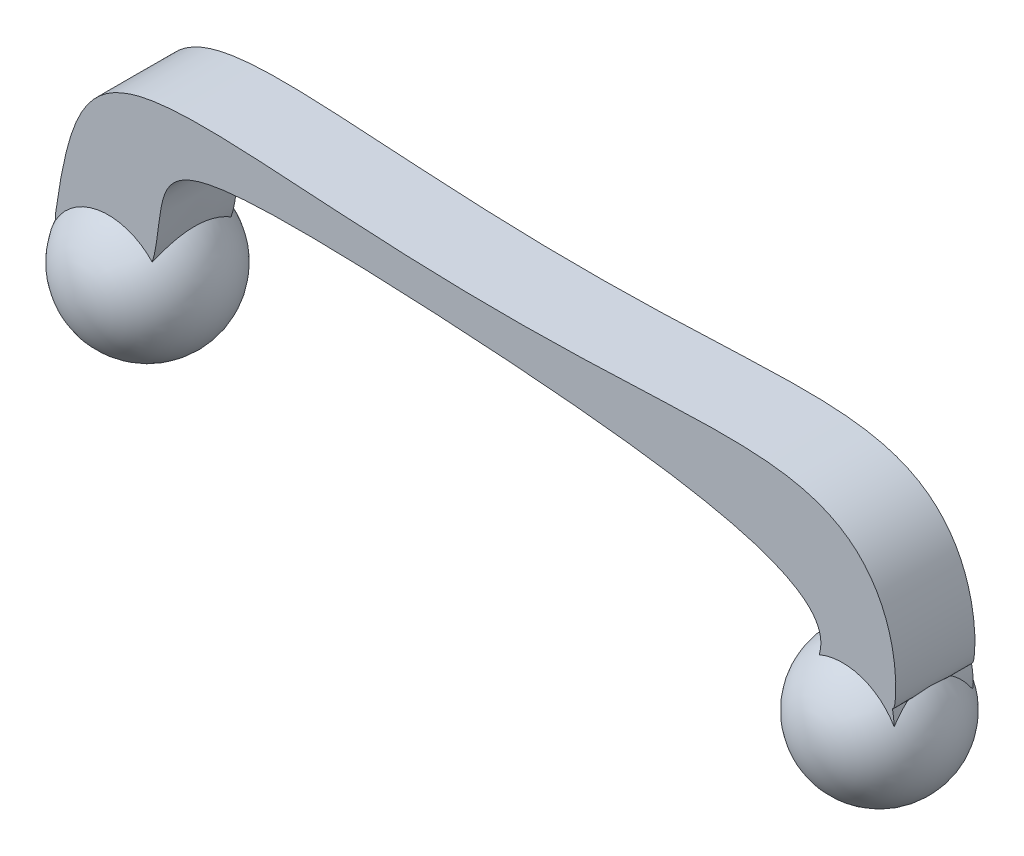
ISO-10303-21;
HEADER;
FILE_DESCRIPTION(('STEP AP214'),'2;1');
FILE_NAME('part.step','',(''),(''),'','','');
FILE_SCHEMA(('AUTOMOTIVE_DESIGN { 1 0 10303 214 1 1 1 1 }'));
ENDSEC;
DATA;
#1=APPLICATION_CONTEXT('core data for automotive mechanical design processes');
#2=APPLICATION_PROTOCOL_DEFINITION('international standard','automotive_design',2000,#1);
#3=PRODUCT_CONTEXT('',#1,'mechanical');
#4=PRODUCT('Part','Part','',(#3));
#5=PRODUCT_RELATED_PRODUCT_CATEGORY('part','',(#4));
#6=PRODUCT_DEFINITION_FORMATION('','',#4);
#7=PRODUCT_DEFINITION_CONTEXT('part definition',#1,'design');
#8=PRODUCT_DEFINITION('design','',#6,#7);
#9=PRODUCT_DEFINITION_SHAPE('','',#8);
#10=(LENGTH_UNIT() NAMED_UNIT(*) SI_UNIT(.MILLI.,.METRE.));
#11=(NAMED_UNIT(*) PLANE_ANGLE_UNIT() SI_UNIT($,.RADIAN.));
#12=(NAMED_UNIT(*) SI_UNIT($,.STERADIAN.) SOLID_ANGLE_UNIT());
#13=UNCERTAINTY_MEASURE_WITH_UNIT(LENGTH_MEASURE(1.E-05),#10,'distance_accuracy_value','');
#14=(GEOMETRIC_REPRESENTATION_CONTEXT(3) GLOBAL_UNCERTAINTY_ASSIGNED_CONTEXT((#13)) GLOBAL_UNIT_ASSIGNED_CONTEXT((#10,
#11,#12)) REPRESENTATION_CONTEXT('',''));
#15=CARTESIAN_POINT('',(0.,0.,0.));
#16=DIRECTION('',(0.,0.,1.));
#17=DIRECTION('',(1.,0.,0.));
#18=AXIS2_PLACEMENT_3D('',#15,#16,#17);
#19=CARTESIAN_POINT('',(-104.482356562855,8.81400948857931,20.));
#20=CARTESIAN_POINT('',(-95.09202808738,75.3130778429761,20.));
#21=CARTESIAN_POINT('',(-84.4902281871782,41.6847358712218,20.));
#22=CARTESIAN_POINT('',(9.726850280041,37.8584270703556,20.));
#23=CARTESIAN_POINT('',(57.4074889076928,30.9924151079737,20.));
#24=CARTESIAN_POINT('',(74.6784281191779,60.2177169992686,20.));
#25=CARTESIAN_POINT('',(116.438403635151,65.8559036124338,20.));
#26=CARTESIAN_POINT('',(108.794341703337,0.968671597092907,20.));
#27=CARTESIAN_POINT('',(107.045589444412,6.59260999092965,20.));
#28=B_SPLINE_CURVE_WITH_KNOTS('',8,(#19,#20,#21,#22,#23,#24,#25,#26,#27),.UNSPECIFIED.,.F.,.F.,
(9,9),(0.,1.),.UNSPECIFIED.);
#29=DIRECTION('',(0.,0.,-1.));
#30=VECTOR('',#29,1.);
#31=SURFACE_OF_LINEAR_EXTRUSION('',#28,#30);
#32=DIRECTION('',(0.,0.,-1.));
#33=VECTOR('',#32,1.);
#34=CARTESIAN_POINT('',(-104.482356562855,8.81400948857931,20.));
#35=LINE('',#34,#33);
#36=CARTESIAN_POINT('',(-104.482356562855,8.81400948857931,1.47437474805452));
#37=VERTEX_POINT('',#36);
#38=CARTESIAN_POINT('',(-104.482356562855,8.81400948857931,0.));
#39=VERTEX_POINT('',#38);
#40=EDGE_CURVE('E217',#37,#39,#35,.T.);
#41=ORIENTED_EDGE('',*,*,#40,.F.);
#42=CARTESIAN_POINT('',(-104.482356562855,8.81400948857931,1.47437474805452));
#43=CARTESIAN_POINT('',(-104.448349344307,9.05486120450175,1.66752577923602));
#44=CARTESIAN_POINT('',(-104.415191793325,9.28777613294737,1.87072953844081));
#45=CARTESIAN_POINT('',(-104.350884125116,9.7361808750417,2.29584194176652));
#46=CARTESIAN_POINT('',(-104.319734107554,9.95166982370556,2.51775151328488));
#47=CARTESIAN_POINT('',(-104.259747662257,10.3636837989235,2.97889687021337));
#48=CARTESIAN_POINT('',(-104.230911650406,10.5602054178664,3.21813575548927));
#49=CARTESIAN_POINT('',(-104.175873326953,10.9327945807937,3.71231859034012));
#50=CARTESIAN_POINT('',(-104.149670923955,11.1088628346252,3.9672619944096));
#51=CARTESIAN_POINT('',(-104.100181745961,11.4393789413262,4.49141396094666));
#52=CARTESIAN_POINT('',(-104.076897774296,11.593806023092,4.76063589093302));
#53=CARTESIAN_POINT('',(-104.03356830889,11.8796355502187,5.31128497180976));
#54=CARTESIAN_POINT('',(-104.013522762355,12.0110383709258,5.5927119236381));
#55=CARTESIAN_POINT('',(-103.976946904269,12.2497159788948,6.16569316470414));
#56=CARTESIAN_POINT('',(-103.960415016666,12.3570015851821,6.45724284483075));
#57=CARTESIAN_POINT('',(-103.9310892889,12.5466378312827,7.04852511056067));
#58=CARTESIAN_POINT('',(-103.918295406392,12.6289887535624,7.34825760342507));
#59=CARTESIAN_POINT('',(-103.896685163428,12.7677415204269,7.95234071964801));
#60=CARTESIAN_POINT('',(-103.887850562606,12.8242623880637,8.25666334641474));
#61=CARTESIAN_POINT('',(-103.874205675768,12.9114388472766,8.86908256650465));
#62=CARTESIAN_POINT('',(-103.869395392018,12.9420944242806,9.17717916195394));
#63=CARTESIAN_POINT('',(-103.8638732399,12.9772795428153,9.79493142187764));
#64=CARTESIAN_POINT('',(-103.863161821568,12.9818062155085,10.1045872538136));
#65=CARTESIAN_POINT('',(-103.865849739549,12.9646867031594,10.7231541651449));
#66=CARTESIAN_POINT('',(-103.869249031195,12.9430408025005,11.0320652525959));
#67=CARTESIAN_POINT('',(-103.880030687959,12.8742396094711,11.6426581921277));
#68=CARTESIAN_POINT('',(-103.887357685637,12.8274388915152,11.9443810558555));
#69=CARTESIAN_POINT('',(-103.905849622282,12.7089488993142,12.5427775707949));
#70=CARTESIAN_POINT('',(-103.917014546207,12.637259722618,12.8394512417916));
#71=CARTESIAN_POINT('',(-103.94302359911,12.4695605408001,13.4257385962349));
#72=CARTESIAN_POINT('',(-103.957868458157,12.3735457095952,13.7153508662228));
#73=CARTESIAN_POINT('',(-103.991029557946,12.1579718663242,14.2854607634097));
#74=CARTESIAN_POINT('',(-104.009345735807,12.0384132807411,14.5659585556056));
#75=CARTESIAN_POINT('',(-104.049339338085,11.7758168959785,15.1177755665874));
#76=CARTESIAN_POINT('',(-104.071038195592,11.6326290139728,15.3890217953192));
#77=CARTESIAN_POINT('',(-104.117434371971,11.3244386773162,15.9185569858142));
#78=CARTESIAN_POINT('',(-104.142131733715,11.1594359107427,16.176845762231));
#79=CARTESIAN_POINT('',(-104.194207510413,10.8090225765707,16.6785231557738));
#80=CARTESIAN_POINT('',(-104.221583363026,10.623631492504,16.9219256582304));
#81=CARTESIAN_POINT('',(-104.278726385181,10.2337249797669,17.3924449810403));
#82=CARTESIAN_POINT('',(-104.308492546346,10.0292176095788,17.6195685930679));
#83=CARTESIAN_POINT('',(-104.362102242241,9.65801043980772,17.9993659301554));
#84=CARTESIAN_POINT('',(-104.385472744995,9.49531055092223,18.1560397691542));
#85=CARTESIAN_POINT('',(-104.433197478164,9.16114138920475,18.4589222138687));
#86=CARTESIAN_POINT('',(-104.457549788032,8.98968907750674,18.6051498347878));
#87=CARTESIAN_POINT('',(-104.482356562855,8.81400948857931,18.7460556834493));
#88=B_SPLINE_CURVE_WITH_KNOTS('',3,(#42,#43,#44,#45,#46,#47,#48,#49,#50,#51,#52,#53,#54,#55,#56,
#57,#58,#59,#60,#61,#62,#63,#64,#65,#66,#67,#68,#69,#70,#71,#72,#73,#74,#75,#76,#77,#78,#79,#80,
#81,#82,#83,#84,#85,#86,#87),.UNSPECIFIED.,.F.,.F.,(4,2,2,2,2,2,2,2,2,2,2,2,2,2,2,2,2,2,2,2,2,2,
4),(0.,0.931548810494979,1.86314383254505,2.79490591171206,3.72663564381903,4.65925360949773,
5.59185637003728,6.5240399246898,7.45621291893606,8.38404610894937,9.31187982169567,
10.2398154045253,11.1677409047812,12.0829171034228,12.9980897151204,13.9134440346736,
14.8287817745774,15.7501744527139,16.6715803069145,17.5921131731836,18.5122597233857,
19.193098630002,19.8726648440729),.UNSPECIFIED.);
#89=CARTESIAN_POINT('',(-104.482356562855,8.81400948857931,18.7460556834494));
#90=VERTEX_POINT('',#89);
#91=EDGE_CURVE('E55',#37,#90,#88,.T.);
#92=ORIENTED_EDGE('',*,*,#91,.T.);
#93=CARTESIAN_POINT('',(-104.482356562855,8.81400948857931,20.));
#94=VERTEX_POINT('',#93);
#95=EDGE_CURVE('E212',#94,#90,#35,.T.);
#96=ORIENTED_EDGE('',*,*,#95,.F.);
#97=CARTESIAN_POINT('',(107.045589444412,6.59260999092965,20.));
#98=VERTEX_POINT('',#97);
#99=EDGE_CURVE('E184',#94,#98,#28,.T.);
#100=ORIENTED_EDGE('',*,*,#99,.T.);
#101=DIRECTION('',(0.,0.,-1.));
#102=VECTOR('',#101,1.);
#103=CARTESIAN_POINT('',(107.045589444412,6.59260999092965,20.));
#104=LINE('',#103,#102);
#105=CARTESIAN_POINT('',(107.045589444412,6.59260999092965,15.3185997622126));
#106=VERTEX_POINT('',#105);
#107=EDGE_CURVE('E218',#98,#106,#104,.T.);
#108=ORIENTED_EDGE('',*,*,#107,.T.);
#109=CARTESIAN_POINT('',(107.045589444412,6.59260999092965,15.3185997622126));
#110=CARTESIAN_POINT('',(107.047852558962,6.58533822645184,15.3307501389425));
#111=CARTESIAN_POINT('',(107.050201666601,6.57797422295706,15.3428317128639));
#112=CARTESIAN_POINT('',(107.055151853106,6.56292681020765,15.3669776545463));
#113=CARTESIAN_POINT('',(107.057755930457,6.55524041518214,15.3790395423399));
#114=CARTESIAN_POINT('',(107.063254072653,6.53956083194176,15.4030075164602));
#115=CARTESIAN_POINT('',(107.066149848902,6.53156602594324,15.4149121570222));
#116=CARTESIAN_POINT('',(107.072704839191,6.5141688540983,15.4399935927868));
#117=CARTESIAN_POINT('',(107.076414354766,6.50472157346992,15.4531267228238));
#118=CARTESIAN_POINT('',(107.08444065505,6.48535603876325,15.4787530013075));
#119=CARTESIAN_POINT('',(107.088754624941,6.47544010143934,15.491248769416));
#120=CARTESIAN_POINT('',(107.098279272054,6.45495774578541,15.5152715706438));
#121=CARTESIAN_POINT('',(107.103485583328,6.44439464831938,15.5268029317068));
#122=CARTESIAN_POINT('',(107.112655092681,6.4274391803011,15.5430560781248));
#123=CARTESIAN_POINT('',(107.116064502342,6.42140101842827,15.5484442939841));
#124=CARTESIAN_POINT('',(107.123467738214,6.40905179602087,15.5582948569977));
#125=CARTESIAN_POINT('',(107.127454704321,6.40274447967277,15.5627667599669));
#126=CARTESIAN_POINT('',(107.136011981557,6.39022691949254,15.5699190962084));
#127=CARTESIAN_POINT('',(107.140519621516,6.38404238489631,15.5727053348342));
#128=CARTESIAN_POINT('',(107.147985447537,6.37474650842743,15.5750689410714));
#129=CARTESIAN_POINT('',(107.1506176039,6.37161731242451,15.5755501724417));
#130=CARTESIAN_POINT('',(107.156060987468,6.36550089655595,15.5757047693377));
#131=CARTESIAN_POINT('',(107.158871593864,6.36251324149844,15.5753808005392));
#132=CARTESIAN_POINT('',(107.16413530546,6.3572586990035,15.5739679843359));
#133=CARTESIAN_POINT('',(107.166579785772,6.35495056975001,15.5729993835283));
#134=CARTESIAN_POINT('',(107.17142887461,6.35062661384059,15.5704753932266));
#135=CARTESIAN_POINT('',(107.173833401214,6.34861133456667,15.5689189239647));
#136=CARTESIAN_POINT('',(107.181778090478,6.34234314794505,15.5628508777395));
#137=CARTESIAN_POINT('',(107.187056909085,6.33884908068374,15.5572289742374));
#138=CARTESIAN_POINT('',(107.196205387076,6.33360993947893,15.5455352102611));
#139=CARTESIAN_POINT('',(107.200166560521,6.33171320646979,15.5395835630594));
#140=CARTESIAN_POINT('',(107.207613259491,6.32864518752891,15.5271930825665));
#141=CARTESIAN_POINT('',(107.211097192782,6.3274762860121,15.5207527247258));
#142=CARTESIAN_POINT('',(107.21979602353,6.3250643270128,15.5034338995626));
#143=CARTESIAN_POINT('',(107.224696535299,6.32425007955465,15.4923463001038));
#144=CARTESIAN_POINT('',(107.233843204618,6.32343006575067,15.4699029356473));
#145=CARTESIAN_POINT('',(107.238089617097,6.32342398362923,15.4585472771233));
#146=CARTESIAN_POINT('',(107.246146631563,6.32395531998289,15.4356142664862));
#147=CARTESIAN_POINT('',(107.249954195186,6.32449630044166,15.4240359492255));
#148=CARTESIAN_POINT('',(107.257216382506,6.32596796877514,15.4008017030097));
#149=CARTESIAN_POINT('',(107.260671139185,6.32689850913595,15.3891458050742));
#150=CARTESIAN_POINT('',(107.271755933684,6.3304793386711,15.3501480372584));
#151=CARTESIAN_POINT('',(107.278784414274,6.33376426707941,15.3226951051847));
#152=CARTESIAN_POINT('',(107.291910938056,6.34121002426353,15.2676822525352));
#153=CARTESIAN_POINT('',(107.298008364365,6.34537142945562,15.2401222733256));
#154=CARTESIAN_POINT('',(107.31533211911,6.35868820342058,15.1572805007289));
#155=CARTESIAN_POINT('',(107.325566988117,6.36866531203198,15.1019258445828));
#156=CARTESIAN_POINT('',(107.344438237709,6.38956209913361,14.9912078676269));
#157=CARTESIAN_POINT('',(107.353076371721,6.40048072415001,14.9358446239472));
#158=CARTESIAN_POINT('',(107.369208098506,6.42275378935918,14.8251066554738));
#159=CARTESIAN_POINT('',(107.376702986327,6.43410771791967,14.7697320159019));
#160=CARTESIAN_POINT('',(107.398259343989,6.46891753718539,14.6007959629428));
#161=CARTESIAN_POINT('',(107.410965703127,6.49257953642849,14.4871060683249));
#162=CARTESIAN_POINT('',(107.434024087816,6.5391158712929,14.2593216668066));
#163=CARTESIAN_POINT('',(107.444375868831,6.5619901248933,14.1452271191293));
#164=CARTESIAN_POINT('',(107.463300349991,6.6063323328985,13.9165448076636));
#165=CARTESIAN_POINT('',(107.471871976319,6.62779943317423,13.8019567884945));
#166=CARTESIAN_POINT('',(107.487577941576,6.66892050139863,13.5723644210124));
#167=CARTESIAN_POINT('',(107.494712335757,6.68857453903119,13.4573600888769));
#168=CARTESIAN_POINT('',(107.514302501314,6.74438569275048,13.1119423151625));
#169=CARTESIAN_POINT('',(107.524961940779,6.77743437113125,12.8809104742257));
#170=CARTESIAN_POINT('',(107.542550591184,6.83399443024698,12.4175350126029));
#171=CARTESIAN_POINT('',(107.549479640987,6.85750539898146,12.1851913356888));
#172=CARTESIAN_POINT('',(107.561263797684,6.89824148326597,11.670406629916));
#173=CARTESIAN_POINT('',(107.565371175372,6.91308823681505,11.3877549755735));
#174=CARTESIAN_POINT('',(107.569311884893,6.92732242839176,10.8219394603947));
#175=CARTESIAN_POINT('',(107.569143696424,6.92670436745152,10.5387754531644));
#176=CARTESIAN_POINT('',(107.564514976742,6.91001315903682,9.9729460240996));
#177=CARTESIAN_POINT('',(107.56005476926,6.89394117719383,9.69028056627236));
#178=CARTESIAN_POINT('',(107.549793281067,6.8586693311314,9.26719537531407));
#179=CARTESIAN_POINT('',(107.545774389501,6.84504081545568,9.12624175760502));
#180=CARTESIAN_POINT('',(107.536424932094,6.81420238959491,8.84476773624824));
#181=CARTESIAN_POINT('',(107.531094374524,6.79699250199693,8.704247329874));
#182=CARTESIAN_POINT('',(107.518956606544,6.75919098421549,8.42374933013637));
#183=CARTESIAN_POINT('',(107.512149610815,6.73859984579199,8.28377166086456));
#184=CARTESIAN_POINT('',(107.496808616556,6.69432279707931,8.00439855895909));
#185=CARTESIAN_POINT('',(107.48827457279,6.67063680573434,7.86500314167362));
#186=CARTESIAN_POINT('',(107.469089562083,6.62063510000773,7.58692318335595));
#187=CARTESIAN_POINT('',(107.458439915975,6.59432103148542,7.4482382538849));
#188=CARTESIAN_POINT('',(107.4343794097,6.53976657704807,7.17149484548618));
#189=CARTESIAN_POINT('',(107.420968772505,6.51152634681001,7.03343631689094));
#190=CARTESIAN_POINT('',(107.398365475537,6.46994973486563,6.8321151541614));
#191=CARTESIAN_POINT('',(107.390793919208,6.45678231506413,6.76863574554017));
#192=CARTESIAN_POINT('',(107.374503294046,6.43064645033206,6.64175011946743));
#193=CARTESIAN_POINT('',(107.365783673245,6.41767810448285,6.57834395211574));
#194=CARTESIAN_POINT('',(107.34678181598,6.39238581189024,6.45155119160617));
#195=CARTESIAN_POINT('',(107.336497892093,6.38006258056741,6.38816469455898));
#196=CARTESIAN_POINT('',(107.319243641669,6.36284055791131,6.29321152068228));
#197=CARTESIAN_POINT('',(107.313190232863,6.35731227767941,6.26159394861818));
#198=CARTESIAN_POINT('',(107.300255888541,6.34693004018303,6.19841951725409));
#199=CARTESIAN_POINT('',(107.293375202446,6.3420758806196,6.16686264255479));
#200=CARTESIAN_POINT('',(107.282118335378,6.3356392304242,6.1195328950671));
#201=CARTESIAN_POINT('',(107.278197109648,6.33362977830654,6.10371057530221));
#202=CARTESIAN_POINT('',(107.269956170562,6.33000876415541,6.07211666272701));
#203=CARTESIAN_POINT('',(107.265636347181,6.32839731243566,6.05634508517374));
#204=CARTESIAN_POINT('',(107.256489480269,6.3257484653172,6.02498337093165));
#205=CARTESIAN_POINT('',(107.251665007912,6.32470831394752,6.00939272475184));
#206=CARTESIAN_POINT('',(107.241272300813,6.32347317685698,5.97840338263721));
#207=CARTESIAN_POINT('',(107.235704000185,6.32327826605657,5.9630047038386));
#208=CARTESIAN_POINT('',(107.226223705139,6.32410553917668,5.93968493221599));
#209=CARTESIAN_POINT('',(107.222726794011,6.32460948258163,5.93158006358988));
#210=CARTESIAN_POINT('',(107.215272081208,6.32623501878439,5.91565745516982));
#211=CARTESIAN_POINT('',(107.211315424799,6.32735510168139,5.90783906310014));
#212=CARTESIAN_POINT('',(107.204302662361,6.32996223947434,5.89548839677843));
#213=CARTESIAN_POINT('',(107.201439797161,6.33116922435294,5.89079200109755));
#214=CARTESIAN_POINT('',(107.195395487357,6.33409747425572,5.88178920076311));
#215=CARTESIAN_POINT('',(107.192214595857,6.33581785639178,5.87748214300109));
#216=CARTESIAN_POINT('',(107.184350573451,6.34064434072475,5.86820095842103));
#217=CARTESIAN_POINT('',(107.179515537337,6.3440192467158,5.86346625040291));
#218=CARTESIAN_POINT('',(107.170154025219,6.3516461495678,5.85688667895855));
#219=CARTESIAN_POINT('',(107.165699457312,6.35567538066994,5.85470346449484));
#220=CARTESIAN_POINT('',(107.15697274609,6.36443274651597,5.85246970277136));
#221=CARTESIAN_POINT('',(107.152700559403,6.36916071388274,5.85241864559734));
#222=CARTESIAN_POINT('',(107.142843066505,6.38093117827406,5.85434459084472));
#223=CARTESIAN_POINT('',(107.137565123224,6.38803215318403,5.85727114731482));
#224=CARTESIAN_POINT('',(107.128303839543,6.40144205870258,5.86468239903027));
#225=CARTESIAN_POINT('',(107.12426681873,6.40777301510556,5.86907656583856));
#226=CARTESIAN_POINT('',(107.116803950214,6.42012405165414,5.8787697936512));
#227=CARTESIAN_POINT('',(107.113380321812,6.42614294909233,5.88407200996016));
#228=CARTESIAN_POINT('',(107.104668762953,6.44214053241178,5.89924047949519));
#229=CARTESIAN_POINT('',(107.099819432417,6.45184071774025,5.90963806378978));
#230=CARTESIAN_POINT('',(107.090920360226,6.47065869140114,5.931279599171));
#231=CARTESIAN_POINT('',(107.086872520874,6.4797750602129,5.94252547839314));
#232=CARTESIAN_POINT('',(107.075518132627,6.50652903207902,5.97712345173626));
#233=CARTESIAN_POINT('',(107.069036847528,6.52349889744387,6.00125815679326));
#234=CARTESIAN_POINT('',(107.059889101119,6.54904546801353,6.03965975799839));
#235=CARTESIAN_POINT('',(107.056801324581,6.55802139046149,6.05358140340903));
#236=CARTESIAN_POINT('',(107.050968106012,6.57557417192083,6.08153822027263));
#237=CARTESIAN_POINT('',(107.048219451351,6.58415419989748,6.09557072506686));
#238=CARTESIAN_POINT('',(107.045589444412,6.59260999092965,6.10970367768127));
#239=B_SPLINE_CURVE_WITH_KNOTS('',3,(#109,#110,#111,#112,#113,#114,#115,#116,#117,#118,#119,
#120,#121,#122,#123,#124,#125,#126,#127,#128,#129,#130,#131,#132,#133,#134,#135,#136,#137,#138,
#139,#140,#141,#142,#143,#144,#145,#146,#147,#148,#149,#150,#151,#152,#153,#154,#155,#156,#157,
#158,#159,#160,#161,#162,#163,#164,#165,#166,#167,#168,#169,#170,#171,#172,#173,#174,#175,#176,
#177,#178,#179,#180,#181,#182,#183,#184,#185,#186,#187,#188,#189,#190,#191,#192,#193,#194,#195,
#196,#197,#198,#199,#200,#201,#202,#203,#204,#205,#206,#207,#208,#209,#210,#211,#212,#213,#214,
#215,#216,#217,#218,#219,#220,#221,#222,#223,#224,#225,#226,#227,#228,#229,#230,#231,#232,#233,
#234,#235,#236,#237,#238),.UNSPECIFIED.,.F.,.F.,(4,2,2,2,2,2,2,2,2,2,2,2,2,2,2,2,2,2,2,2,2,2,2,
2,2,2,2,2,2,2,2,2,2,2,2,2,2,2,2,2,2,2,2,2,2,2,2,2,2,2,2,2,2,2,2,2,2,2,2,2,2,2,2,2,4),(0.,
0.0430220791607515,0.0866306696857267,0.130511933121667,0.180281834547096,0.229827228484364,
0.279136792794674,0.305434013401962,0.331441207654747,0.355575841309644,0.367859487292767,
0.380102521542884,0.390534321360239,0.400985375712715,0.425886720710976,0.448009371555445,
0.470204121244362,0.506564243656248,0.542910158982624,0.579494259997243,0.616064520293505,
0.701589049663378,0.787170000979146,0.958608915612407,1.12985843435391,1.30091250074239,
1.65132890921604,2.00178169376999,2.35244526691034,2.70309535690478,3.40374067185146,
4.10441624935363,4.95316404657225,5.80221364522373,6.65119920826159,7.07616039423738,
7.50111890014208,7.92601565588632,8.35092354212589,8.77556697461402,9.20017612698477,
9.39598227087646,9.59188290096038,9.78799636893359,9.88597618466469,9.98392653349574,
10.0331932339948,10.0824735744529,10.1315140489227,10.1805588701536,10.207061027722,
10.2334985270345,10.2503556447688,10.2671839387915,10.2894915427093,10.3082752999314,
10.3270545649144,10.3545251673337,10.3805438517404,10.4066548520807,10.4516175138604,
10.4966856458883,10.5871565070317,10.6377042783162,10.6877288370415),.UNSPECIFIED.);
#240=CARTESIAN_POINT('',(107.045589444412,6.59260999092965,6.10970367768127));
#241=VERTEX_POINT('',#240);
#242=EDGE_CURVE('E169',#106,#241,#239,.T.);
#243=ORIENTED_EDGE('',*,*,#242,.T.);
#244=CARTESIAN_POINT('',(107.045589444412,6.59260999092965,0.));
#245=VERTEX_POINT('',#244);
#246=EDGE_CURVE('E199',#241,#245,#104,.T.);
#247=ORIENTED_EDGE('',*,*,#246,.T.);
#248=CARTESIAN_POINT('',(-104.482356562855,8.81400948857931,0.));
#249=CARTESIAN_POINT('',(-95.09202808738,75.3130778429761,0.));
#250=CARTESIAN_POINT('',(-84.4902281871782,41.6847358712218,0.));
#251=CARTESIAN_POINT('',(9.726850280041,37.8584270703556,0.));
#252=CARTESIAN_POINT('',(57.4074889076928,30.9924151079737,0.));
#253=CARTESIAN_POINT('',(74.6784281191779,60.2177169992686,0.));
#254=CARTESIAN_POINT('',(116.438403635151,65.8559036124338,0.));
#255=CARTESIAN_POINT('',(108.794341703337,0.968671597092907,0.));
#256=CARTESIAN_POINT('',(107.045589444412,6.59260999092965,0.));
#257=B_SPLINE_CURVE_WITH_KNOTS('',8,(#248,#249,#250,#251,#252,#253,#254,#255,#256),
.UNSPECIFIED.,.F.,.F.,(9,9),(0.,1.),.UNSPECIFIED.);
#258=EDGE_CURVE('E183',#39,#245,#257,.T.);
#259=ORIENTED_EDGE('',*,*,#258,.F.);
#260=EDGE_LOOP('',(#41,#92,#96,#100,#108,#243,#247,#259));
#261=FACE_BOUND('',#260,.T.);
#262=ADVANCED_FACE('F32',(#261),#31,.T.);
#263=CARTESIAN_POINT('',(-104.482356562855,8.81400948857931,20.));
#264=CARTESIAN_POINT('',(-106.851495512109,-7.96341563972739,20.));
#265=CARTESIAN_POINT('',(-9.8717407537741,19.4449769176166,20.));
#266=CARTESIAN_POINT('',(-156.791552815874,7.58812876636257,20.));
#267=CARTESIAN_POINT('',(-45.7243576763318,9.55913881040034,20.));
#268=CARTESIAN_POINT('',(-64.1731798607672,35.9725655903928,20.));
#269=CARTESIAN_POINT('',(-32.2861817612424,41.9358085012162,20.));
#270=CARTESIAN_POINT('',(-237.683518259279,69.8556765459144,20.));
#271=CARTESIAN_POINT('',(4.9252582384967,19.7980447947561,20.));
#272=CARTESIAN_POINT('',(19.6108949358135,19.7980447947561,20.));
#273=CARTESIAN_POINT('',(57.0219578421327,33.3722394558484,20.));
#274=CARTESIAN_POINT('',(49.4557700520641,67.884603203788,20.));
#275=CARTESIAN_POINT('',(163.768174954698,10.5195511901015,20.));
#276=CARTESIAN_POINT('',(193.852701526653,8.81798735206147,20.));
#277=CARTESIAN_POINT('',(2.88316901809189,15.6221251497625,20.));
#278=CARTESIAN_POINT('',(61.7437924034832,-21.4009411711125,20.));
#279=CARTESIAN_POINT('',(82.7834062091598,-9.42011170417134,20.));
#280=CARTESIAN_POINT('',(85.9823439055049,-9.19178349085623,20.));
#281=CARTESIAN_POINT('',(100.987894808591,19.7290939178755,20.));
#282=CARTESIAN_POINT('',(105.706260744179,-8.63533927718989,20.));
#283=CARTESIAN_POINT('',(109.280197308827,-4.80184856970922,20.));
#284=CARTESIAN_POINT('',(107.045589444412,6.59260999092965,20.));
#285=B_SPLINE_CURVE_WITH_KNOTS('',21,(#263,#264,#265,#266,#267,#268,#269,#270,#271,#272,#273,
#274,#275,#276,#277,#278,#279,#280,#281,#282,#283,#284),.UNSPECIFIED.,.F.,.F.,(22,22),(0.,1.),.UNSPECIFIED.);
#286=DIRECTION('',(0.,0.,-1.));
#287=VECTOR('',#286,1.);
#288=SURFACE_OF_LINEAR_EXTRUSION('',#285,#287);
#289=CARTESIAN_POINT('',(-104.380487061921,7.56102893982295,20.));
#290=CARTESIAN_POINT('',(-104.3929606359,7.59838819840083,19.9547103561699));
#291=CARTESIAN_POINT('',(-104.40462874606,7.63622487725829,19.9095890018615));
#292=CARTESIAN_POINT('',(-104.426230976571,7.71266167325386,19.8200015793983));
#293=CARTESIAN_POINT('',(-104.436173884277,7.75125673549716,19.7755333140283));
#294=CARTESIAN_POINT('',(-104.454297000675,7.8292475267236,19.6872784670763));
#295=CARTESIAN_POINT('',(-104.462484419772,7.86863922383292,19.6434898100656));
#296=CARTESIAN_POINT('',(-104.477061995663,7.94826232037734,19.5566237655627));
#297=CARTESIAN_POINT('',(-104.483457481701,7.98849083931815,19.5135446355018));
#298=CARTESIAN_POINT('',(-104.494410824786,8.06983005720382,19.4281283105753));
#299=CARTESIAN_POINT('',(-104.498971767779,8.11093915114154,19.3857899853308));
#300=CARTESIAN_POINT('',(-104.506212988554,8.19412742044178,19.301845022276));
#301=CARTESIAN_POINT('',(-104.508891775794,8.23620733745667,19.2602389897552));
#302=CARTESIAN_POINT('',(-104.512307088172,8.32133734790308,19.1778454676497));
#303=CARTESIAN_POINT('',(-104.513041286445,8.36438854151325,19.1370590165979));
#304=CARTESIAN_POINT('',(-104.512507926483,8.45150098699983,19.056350906297));
#305=CARTESIAN_POINT('',(-104.511234918188,8.49556466766716,19.0164319009554));
#306=CARTESIAN_POINT('',(-104.506621331097,8.58474420903234,18.9375066224349));
#307=CARTESIAN_POINT('',(-104.503271676336,8.62986384731573,18.8985051401383));
#308=CARTESIAN_POINT('',(-104.494436899107,8.72119528551601,18.8214624166259));
#309=CARTESIAN_POINT('',(-104.488938572777,8.76741214593771,18.7834286921407));
#310=CARTESIAN_POINT('',(-104.482356562855,8.81400948857931,18.7460556834493));
#311=B_SPLINE_CURVE_WITH_KNOTS('',3,(#289,#290,#291,#292,#293,#294,#295,#296,#297,#298,#299,
#300,#301,#302,#303,#304,#305,#306,#307,#308,#309,#310),.UNSPECIFIED.,.F.,.F.,(4,2,2,2,2,2,2,2,
2,2,4),(0.,0.18005795779018,0.359169995462681,0.537531633143454,0.71535704875452,
0.892882074551347,1.07054753032035,1.24842548203536,1.42678724856942,1.60593409314001,
1.78619958180483),.UNSPECIFIED.);
#312=CARTESIAN_POINT('',(-104.380487061921,7.56102893982297,20.));
#313=VERTEX_POINT('',#312);
#314=EDGE_CURVE('E150',#313,#90,#311,.T.);
#315=ORIENTED_EDGE('',*,*,#314,.F.);
#316=EDGE_CURVE('E190',#94,#313,#285,.T.);
#317=ORIENTED_EDGE('',*,*,#316,.F.);
#318=ORIENTED_EDGE('',*,*,#95,.T.);
#319=EDGE_LOOP('',(#315,#317,#318));
#320=FACE_BOUND('',#319,.T.);
#321=ADVANCED_FACE('F130',(#320),#288,.F.);
#322=CARTESIAN_POINT('',(-80.0944775552738,10.3510536571602,0.));
#323=CARTESIAN_POINT('',(-80.0434255043472,10.4847100918788,0.192498687491379));
#324=CARTESIAN_POINT('',(-79.9962092276521,10.6164139061167,0.387359709589919));
#325=CARTESIAN_POINT('',(-79.9083711101709,10.8749161054615,0.781932547289288));
#326=CARTESIAN_POINT('',(-79.8677530760514,11.0017116269687,0.981647087152082));
#327=CARTESIAN_POINT('',(-79.7920785015831,11.2492805230381,1.38589647781907));
#328=CARTESIAN_POINT('',(-79.7570237457098,11.3700519568323,1.59043285120795));
#329=CARTESIAN_POINT('',(-79.6916663072656,11.6046639297529,2.00421397649823));
#330=CARTESIAN_POINT('',(-79.6613640549189,11.7185038408277,2.21345915270938));
#331=CARTESIAN_POINT('',(-79.604735839619,11.938914007366,2.63732131897376));
#332=CARTESIAN_POINT('',(-79.5784257514964,12.0454543608836,2.8519559932777));
#333=CARTESIAN_POINT('',(-79.5293966558604,12.2501159881416,3.28555431269767));
#334=CARTESIAN_POINT('',(-79.5066769284922,12.348238947732,3.50451708011584));
#335=CARTESIAN_POINT('',(-79.4644099004871,12.5355318380982,3.94650318183253));
#336=CARTESIAN_POINT('',(-79.4448620975936,12.6247031854577,4.16952586703331));
#337=CARTESIAN_POINT('',(-79.408614233967,12.7936499274257,4.61932281735376));
#338=CARTESIAN_POINT('',(-79.3919141410834,12.8734254281096,4.84609704008708));
#339=CARTESIAN_POINT('',(-79.3558853263562,13.0486015982054,5.38054339092449));
#340=CARTESIAN_POINT('',(-79.3375861301891,13.1401249508703,5.68956672310896));
#341=CARTESIAN_POINT('',(-79.3052039119128,13.3048888786275,6.31271429186263));
#342=CARTESIAN_POINT('',(-79.2911215636419,13.3781265314155,6.62683933522233));
#343=CARTESIAN_POINT('',(-79.2668778573151,13.5057428954554,7.25906639573839));
#344=CARTESIAN_POINT('',(-79.2567166552556,13.5601208563966,7.57716857059874));
#345=CARTESIAN_POINT('',(-79.2401425751214,13.6494834620074,8.2152803072394));
#346=CARTESIAN_POINT('',(-79.2337193421786,13.6845216673622,8.53528209505777));
#347=CARTESIAN_POINT('',(-79.2244621095309,13.7351834972108,9.17685578585968));
#348=CARTESIAN_POINT('',(-79.2216279380319,13.7508080509575,9.49842761295203));
#349=CARTESIAN_POINT('',(-79.2194992721234,13.76253323369,10.1419083441699));
#350=CARTESIAN_POINT('',(-79.2202044013958,13.7586359383473,10.463817208821));
#351=CARTESIAN_POINT('',(-79.2249731531066,13.7324116537487,11.0817997908826));
#352=CARTESIAN_POINT('',(-79.2287716949438,13.7115394596587,11.3779383580276));
#353=CARTESIAN_POINT('',(-79.2394465455141,13.6533438876979,11.9685311883577));
#354=CARTESIAN_POINT('',(-79.2463227558964,13.6160210355284,12.2629855050605));
#355=CARTESIAN_POINT('',(-79.2632597985085,13.5251538776838,12.8492873574765));
#356=CARTESIAN_POINT('',(-79.2733206548786,13.4716094490457,13.1411348734123));
#357=CARTESIAN_POINT('',(-79.2968170661429,13.3485191407701,13.72188594625));
#358=CARTESIAN_POINT('',(-79.3102590996575,13.278942563916,14.010782730635));
#359=CARTESIAN_POINT('',(-79.3407533346254,13.1243060562426,14.5841990697348));
#360=CARTESIAN_POINT('',(-79.3578054840004,13.03924634878,14.8687186875296));
#361=CARTESIAN_POINT('',(-79.3958632089969,12.8542441404478,15.4325591175157));
#362=CARTESIAN_POINT('',(-79.4168681772492,12.7543039265303,15.7118807211702));
#363=CARTESIAN_POINT('',(-79.460099493265,12.5550964299803,16.2263859906677));
#364=CARTESIAN_POINT('',(-79.4817541132674,12.4576516592258,16.4623264235617));
#365=CARTESIAN_POINT('',(-79.5287722752167,12.2528439200302,16.9294678864455));
#366=CARTESIAN_POINT('',(-79.5541355890653,12.1454815617068,17.1606692069119));
#367=CARTESIAN_POINT('',(-79.6091153949745,11.921515848108,17.6180519032639));
#368=CARTESIAN_POINT('',(-79.6387321983841,11.8049118166365,17.8442329102696));
#369=CARTESIAN_POINT('',(-79.702797134104,11.5637616219658,18.2904720390243));
#370=CARTESIAN_POINT('',(-79.7372262114338,11.4392477911913,18.5105503946205));
#371=CARTESIAN_POINT('',(-79.8118886581884,11.182851393803,18.9453535866013));
#372=CARTESIAN_POINT('',(-79.8521216600524,11.0509692941431,19.160078760992));
#373=CARTESIAN_POINT('',(-79.9176548959337,10.8485135613506,19.4780944929504));
#374=CARTESIAN_POINT('',(-79.9403610361092,10.7802624329522,19.5834119717847));
#375=CARTESIAN_POINT('',(-79.98766974133,10.6423774050121,19.7927077235015));
#376=CARTESIAN_POINT('',(-80.0122723131234,10.572743500551,19.896685991617));
#377=CARTESIAN_POINT('',(-80.0379069411627,10.502500871117,20.));
#378=B_SPLINE_CURVE_WITH_KNOTS('',3,(#322,#323,#324,#325,#326,#327,#328,#329,#330,#331,#332,
#333,#334,#335,#336,#337,#338,#339,#340,#341,#342,#343,#344,#345,#346,#347,#348,#349,#350,#351,
#352,#353,#354,#355,#356,#357,#358,#359,#360,#361,#362,#363,#364,#365,#366,#367,#368,#369,#370,
#371,#372,#373,#374,#375,#376,#377),.UNSPECIFIED.,.F.,.F.,(4,2,2,2,2,2,2,2,2,2,2,2,2,2,2,2,2,2,
2,2,2,2,2,2,2,2,2,4),(0.,0.719477086040764,1.43936779079659,2.15948894280146,2.87967524676277,
3.60265427387279,4.32548816178454,5.04820748104092,5.77091864029845,6.73874850781748,
7.70673294887907,8.67475589564312,9.64008431489436,10.6053665259986,11.5705461051114,
12.4607677970226,13.350961042849,14.2411610366934,15.1330798978888,16.0249858934441,
16.9167549551652,17.6850590867626,18.4533159846837,19.2216291465347,19.986981968811,
20.752286342799,21.1348711658601,21.5174573503131),.UNSPECIFIED.);
#379=CARTESIAN_POINT('',(-80.0944775552738,10.3510536571602,0.));
#380=VERTEX_POINT('',#379);
#381=CARTESIAN_POINT('',(-80.0379069411627,10.502500871117,20.));
#382=VERTEX_POINT('',#381);
#383=EDGE_CURVE('E111',#380,#382,#378,.T.);
#384=ORIENTED_EDGE('',*,*,#383,.F.);
#385=CARTESIAN_POINT('',(-104.482356562855,8.81400948857931,0.));
#386=CARTESIAN_POINT('',(-106.851495512109,-7.96341563972739,0.));
#387=CARTESIAN_POINT('',(-9.8717407537741,19.4449769176166,0.));
#388=CARTESIAN_POINT('',(-156.791552815874,7.58812876636257,0.));
#389=CARTESIAN_POINT('',(-45.7243576763318,9.55913881040034,0.));
#390=CARTESIAN_POINT('',(-64.1731798607672,35.9725655903928,0.));
#391=CARTESIAN_POINT('',(-32.2861817612424,41.9358085012162,0.));
#392=CARTESIAN_POINT('',(-237.683518259279,69.8556765459144,0.));
#393=CARTESIAN_POINT('',(4.9252582384967,19.7980447947561,0.));
#394=CARTESIAN_POINT('',(19.6108949358135,19.7980447947561,0.));
#395=CARTESIAN_POINT('',(57.0219578421327,33.3722394558484,0.));
#396=CARTESIAN_POINT('',(49.4557700520641,67.884603203788,0.));
#397=CARTESIAN_POINT('',(163.768174954698,10.5195511901015,0.));
#398=CARTESIAN_POINT('',(193.852701526653,8.81798735206147,0.));
#399=CARTESIAN_POINT('',(2.88316901809189,15.6221251497625,0.));
#400=CARTESIAN_POINT('',(61.7437924034832,-21.4009411711125,0.));
#401=CARTESIAN_POINT('',(82.7834062091598,-9.42011170417134,0.));
#402=CARTESIAN_POINT('',(85.9823439055049,-9.19178349085623,0.));
#403=CARTESIAN_POINT('',(100.987894808591,19.7290939178755,0.));
#404=CARTESIAN_POINT('',(105.706260744179,-8.63533927718989,0.));
#405=CARTESIAN_POINT('',(109.280197308827,-4.80184856970922,0.));
#406=CARTESIAN_POINT('',(107.045589444412,6.59260999092965,0.));
#407=B_SPLINE_CURVE_WITH_KNOTS('',21,(#385,#386,#387,#388,#389,#390,#391,#392,#393,#394,#395,
#396,#397,#398,#399,#400,#401,#402,#403,#404,#405,#406),.UNSPECIFIED.,.F.,.F.,(22,22),(0.,1.),.UNSPECIFIED.);
#408=CARTESIAN_POINT('',(88.1329043486254,7.52981624940462,0.));
#409=VERTEX_POINT('',#408);
#410=EDGE_CURVE('E98',#380,#409,#407,.T.);
#411=ORIENTED_EDGE('',*,*,#410,.T.);
#412=CARTESIAN_POINT('',(88.5854621320023,8.82519863040898,20.0000000000002));
#413=CARTESIAN_POINT('',(88.6335311732887,8.98931303172512,19.786383552357));
#414=CARTESIAN_POINT('',(88.6759792238058,9.14696498143554,19.5666701473558));
#415=CARTESIAN_POINT('',(88.7509013455328,9.44858205840997,19.1172023225055));
#416=CARTESIAN_POINT('',(88.783399881198,9.59258014623147,18.8874741443656));
#417=CARTESIAN_POINT('',(88.8398977098097,9.86685733710154,18.4192043971245));
#418=CARTESIAN_POINT('',(88.8639024211963,9.99714514889417,18.1806685543302));
#419=CARTESIAN_POINT('',(88.9047098416735,10.2429897153735,17.6979223907251));
#420=CARTESIAN_POINT('',(88.9215676911756,10.3586542361701,17.4537714296078));
#421=CARTESIAN_POINT('',(88.949715274,10.5764626995782,16.9590577604305));
#422=CARTESIAN_POINT('',(88.9610019520472,10.6785992009022,16.7084916132789));
#423=CARTESIAN_POINT('',(88.979269771667,10.8693426471785,16.202069648976));
#424=CARTESIAN_POINT('',(88.9862501234149,10.9579471079737,15.9462128703566));
#425=CARTESIAN_POINT('',(88.9970090789631,11.1210052412459,15.4323507210743));
#426=CARTESIAN_POINT('',(89.0008141960129,11.1955719844187,15.1743816844044));
#427=CARTESIAN_POINT('',(89.0063024702195,11.3315651263945,14.6550494258894));
#428=CARTESIAN_POINT('',(89.0079860989295,11.3929944427934,14.3936869713686));
#429=CARTESIAN_POINT('',(89.0100579155083,11.5028388816901,13.8682556834923));
#430=CARTESIAN_POINT('',(89.0104461707886,11.5512546812922,13.6041869916871));
#431=CARTESIAN_POINT('',(89.0105864105658,11.6352791506487,13.0733340584169));
#432=CARTESIAN_POINT('',(89.0103367704477,11.6708548555839,12.8065446102655));
#433=CARTESIAN_POINT('',(89.0096909585738,11.7291034682956,12.2715481372601));
#434=CARTESIAN_POINT('',(89.0092947810155,11.751775865061,12.0033410566881));
#435=CARTESIAN_POINT('',(89.0086648551988,11.7842672362902,11.466145628045));
#436=CARTESIAN_POINT('',(89.0084311199101,11.794085184475,11.1971572193119));
#437=CARTESIAN_POINT('',(89.0082346599107,11.8032958217615,10.4684527696551));
#438=CARTESIAN_POINT('',(89.0085809286379,11.7903878675514,10.0085215135566));
#439=CARTESIAN_POINT('',(89.0097275221075,11.7270412184641,9.09120967241004));
#440=CARTESIAN_POINT('',(89.0105279227204,11.6765962519436,8.63382952646587));
#441=CARTESIAN_POINT('',(89.0105279115246,11.5378565584473,7.72486352278374));
#442=CARTESIAN_POINT('',(89.0097276635453,11.4495657058015,7.27327707680996));
#443=CARTESIAN_POINT('',(89.0030128683837,11.2346421636446,6.37941372094756));
#444=CARTESIAN_POINT('',(88.9970999372196,11.1080215976178,5.93713391465702));
#445=CARTESIAN_POINT('',(88.9779289572112,10.8517827929114,5.17281401181984));
#446=CARTESIAN_POINT('',(88.9668295405458,10.7305257810891,4.84790222953277));
#447=CARTESIAN_POINT('',(88.9363539486199,10.4657102031041,4.20763130155849));
#448=CARTESIAN_POINT('',(88.9169778984162,10.3221519739255,3.89227201161374));
#449=CARTESIAN_POINT('',(88.8672320442249,10.0133519971055,3.27472150275955));
#450=CARTESIAN_POINT('',(88.836904452641,9.84819503944594,2.97248464787289));
#451=CARTESIAN_POINT('',(88.762349437822,9.49612639042012,2.38277488615938));
#452=CARTESIAN_POINT('',(88.7181276090311,9.30922347399301,2.09529609117986));
#453=CARTESIAN_POINT('',(88.6343267039935,8.99436002069173,1.65100456894762));
#454=CARTESIAN_POINT('',(88.6001024201345,8.87313009318646,1.48836560282201));
#455=CARTESIAN_POINT('',(88.5252714220654,8.62354874712989,1.17022340745365));
#456=CARTESIAN_POINT('',(88.4846665552297,8.49519939680766,1.01471812957364));
#457=CARTESIAN_POINT('',(88.3964399002132,8.23109803749091,0.710872955326084));
#458=CARTESIAN_POINT('',(88.3487864415322,8.09531445638777,0.562569636394647));
#459=CARTESIAN_POINT('',(88.2462985704794,7.81728153004435,0.274591098267608));
#460=CARTESIAN_POINT('',(88.1914598981798,7.67502838208985,0.134921070399673));
#461=CARTESIAN_POINT('',(88.1329043486254,7.52981624940459,0.));
#462=B_SPLINE_CURVE_WITH_KNOTS('',3,(#412,#413,#414,#415,#416,#417,#418,#419,#420,#421,#422,
#423,#424,#425,#426,#427,#428,#429,#430,#431,#432,#433,#434,#435,#436,#437,#438,#439,#440,#441,
#442,#443,#444,#445,#446,#447,#448,#449,#450,#451,#452,#453,#454,#455,#456,#457,#458,#459,#460,
#461),.UNSPECIFIED.,.F.,.F.,(4,2,2,2,2,2,2,2,2,2,2,2,2,2,2,2,2,2,2,2,2,2,2,2,4),(0.,
0.82055428155881,1.63907442397016,2.45707146486877,3.26863717022096,4.08064745160523,
4.89280661982912,5.69811439539951,6.50324313985719,7.30832998466378,8.11546929608006,
8.92264057049359,9.729876284259,11.1085743542144,12.4875028272845,13.866290171449,
15.2446418673773,16.2847384268525,17.3248192714066,18.3609332129755,19.3966305020091,
20.0134814272537,20.6301540831888,21.2496868178846,21.8695885337835),.UNSPECIFIED.);
#463=CARTESIAN_POINT('',(88.5854621320029,8.82519863040997,20.));
#464=VERTEX_POINT('',#463);
#465=EDGE_CURVE('E163',#464,#409,#462,.T.);
#466=ORIENTED_EDGE('',*,*,#465,.F.);
#467=EDGE_CURVE('E113',#382,#464,#285,.T.);
#468=ORIENTED_EDGE('',*,*,#467,.F.);
#469=EDGE_LOOP('',(#384,#411,#466,#468));
#470=FACE_BOUND('',#469,.T.);
#471=ADVANCED_FACE('F112',(#470),#288,.F.);
#472=CARTESIAN_POINT('',(-104.482356562855,8.81400948857931,1.47437474805452));
#473=CARTESIAN_POINT('',(-104.492417204556,8.7428329123997,1.41729722962782));
#474=CARTESIAN_POINT('',(-104.499937575078,8.67255763727088,1.35867546376837));
#475=CARTESIAN_POINT('',(-104.510035611841,8.53408087504801,1.23881420993231));
#476=CARTESIAN_POINT('',(-104.512620246179,8.46587659835435,1.17757853731484));
#477=CARTESIAN_POINT('',(-104.513012186909,8.33163183232789,1.05281620768154));
#478=CARTESIAN_POINT('',(-104.510820980763,8.26559067578153,0.989290270042579));
#479=CARTESIAN_POINT('',(-104.50194135736,8.13678680868023,0.86135241483083));
#480=CARTESIAN_POINT('',(-104.495325864752,8.0739884458945,0.796971197016959));
#481=CARTESIAN_POINT('',(-104.477885108366,7.95058432169983,0.666680940370032));
#482=CARTESIAN_POINT('',(-104.467059096291,7.88997895212651,0.600771631921696));
#483=CARTESIAN_POINT('',(-104.441427704776,7.77099262544675,0.467777011486278));
#484=CARTESIAN_POINT('',(-104.426623716306,7.7126108989365,0.400692118213027));
#485=CARTESIAN_POINT('',(-104.396385754369,7.60875463748689,0.27826479607019));
#486=CARTESIAN_POINT('',(-104.381589014051,7.56291053793982,0.223076198317995));
#487=CARTESIAN_POINT('',(-104.349559713657,7.47242679502826,0.111982608334735));
#488=CARTESIAN_POINT('',(-104.332316470941,7.42779351487071,0.0560755078904944));
#489=CARTESIAN_POINT('',(-104.313939355991,7.3838553733372,0.));
#490=B_SPLINE_CURVE_WITH_KNOTS('',3,(#472,#473,#474,#475,#476,#477,#478,#479,#480,#481,#482,
#483,#484,#485,#486,#487,#488,#489),.UNSPECIFIED.,.F.,.F.,(4,2,2,2,2,2,2,2,4),(0.,
0.275288992596755,0.550189053734392,0.825003507888919,1.09539636324585,1.3658372951668,
1.63618378549104,1.85589902105916,2.076604987105),.UNSPECIFIED.);
#491=CARTESIAN_POINT('',(-104.313939355991,7.38385537333717,0.));
#492=VERTEX_POINT('',#491);
#493=EDGE_CURVE('E48',#37,#492,#490,.T.);
#494=ORIENTED_EDGE('',*,*,#493,.F.);
#495=ORIENTED_EDGE('',*,*,#40,.T.);
#496=EDGE_CURVE('E106',#39,#492,#407,.T.);
#497=ORIENTED_EDGE('',*,*,#496,.T.);
#498=EDGE_LOOP('',(#494,#495,#497));
#499=FACE_BOUND('',#498,.T.);
#500=ADVANCED_FACE('F239',(#499),#288,.F.);
#501=CARTESIAN_POINT('',(94.5172401043143,-5.,10.7141517199469));
#502=DIRECTION('',(0.,0.,1.));
#503=DIRECTION('',(-1.,0.,0.));
#504=AXIS2_PLACEMENT_3D('',#501,#502,#503);
#505=SPHERICAL_SURFACE('',#504,17.6790578188786);
#506=ORIENTED_EDGE('',*,*,#242,.F.);
#507=CARTESIAN_POINT('',(107.045589444412,6.59260999092965,15.3185997622126));
#508=CARTESIAN_POINT('',(107.063109295693,6.50326190752298,15.4958926344762));
#509=CARTESIAN_POINT('',(107.081189135957,6.40914570782058,15.6707041825069));
#510=CARTESIAN_POINT('',(107.118067884283,6.21211068068246,16.0147484307757));
#511=CARTESIAN_POINT('',(107.136865272831,6.10920994003063,16.1839916452855));
#512=CARTESIAN_POINT('',(107.174833230996,5.89507933542142,16.5168372529987));
#513=CARTESIAN_POINT('',(107.194003421821,5.78385762920151,16.6804449471382));
#514=CARTESIAN_POINT('',(107.232344619471,5.55356910714628,17.0019847241591));
#515=CARTESIAN_POINT('',(107.251515625319,5.43450390740154,17.1599179659176));
#516=CARTESIAN_POINT('',(107.289133908115,5.19110261640898,17.4674776443065));
#517=CARTESIAN_POINT('',(107.307587912674,5.06688646226537,17.617198330849));
#518=CARTESIAN_POINT('',(107.343669969828,4.81190740173411,17.9111262996559));
#519=CARTESIAN_POINT('',(107.361297793662,4.68114270262098,18.0553320528892));
#520=CARTESIAN_POINT('',(107.395228293373,4.41366647071756,18.3382966396242));
#521=CARTESIAN_POINT('',(107.411530840082,4.27695436025353,18.4770549415121));
#522=CARTESIAN_POINT('',(107.442222155313,3.99826083933028,18.7492864661575));
#523=CARTESIAN_POINT('',(107.456611636608,3.85628141673569,18.8827616442193));
#524=CARTESIAN_POINT('',(107.475382015597,3.64915659384192,19.0708839876025));
#525=CARTESIAN_POINT('',(107.480827546036,3.58587967259807,19.1274979802914));
#526=CARTESIAN_POINT('',(107.491147107345,3.45852840543487,19.2398395717316));
#527=CARTESIAN_POINT('',(107.496021299819,3.39445429070096,19.2955674172559));
#528=CARTESIAN_POINT('',(107.505121478857,3.26556683172122,19.4061975352243));
#529=CARTESIAN_POINT('',(107.509347548951,3.20075358389284,19.4610999132297));
#530=CARTESIAN_POINT('',(107.517085303893,3.07008284316542,19.5704595149716));
#531=CARTESIAN_POINT('',(107.520592802333,3.00422151307972,19.6249124496608));
#532=CARTESIAN_POINT('',(107.526762314797,2.87188866532617,19.7331373925352));
#533=CARTESIAN_POINT('',(107.529424221857,2.80541707155598,19.7869093137499));
#534=CARTESIAN_POINT('',(107.533781358159,2.6719495001888,19.8938712456588));
#535=CARTESIAN_POINT('',(107.535476353507,2.60495339968436,19.9470611125058));
#536=CARTESIAN_POINT('',(107.536626910686,2.53774994737553,20.));
#537=B_SPLINE_CURVE_WITH_KNOTS('',3,(#507,#508,#509,#510,#511,#512,#513,#514,#515,#516,#517,
#518,#519,#520,#521,#522,#523,#524,#525,#526,#527,#528,#529,#530,#531,#532,#533,#534,#535,#536),
.UNSPECIFIED.,.F.,.F.,(4,2,2,2,2,2,2,2,2,2,2,2,2,2,4),(0.,0.597814441933308,1.19442641321944,
1.79046095326651,2.38637306685828,2.97241691060682,3.55862207584717,4.14488430704671,
4.73092749187033,4.98616273667327,5.24132561314782,5.4964555767912,5.75303212051431,
6.00964110713902,6.26631214069767),.UNSPECIFIED.);
#538=CARTESIAN_POINT('',(107.536626910686,2.53774994737544,20.));
#539=VERTEX_POINT('',#538);
#540=EDGE_CURVE('E177',#106,#539,#537,.T.);
#541=ORIENTED_EDGE('',*,*,#540,.T.);
#542=CARTESIAN_POINT('',(94.5172401043143,-5.,20.));
#543=DIRECTION('',(0.,0.,1.));
#544=DIRECTION('',(1.,0.,0.));
#545=AXIS2_PLACEMENT_3D('',#542,#543,#544);
#546=CIRCLE('',#545,15.0440056860893);
#547=EDGE_CURVE('E175',#464,#539,#546,.F.);
#548=ORIENTED_EDGE('',*,*,#547,.F.);
#549=ORIENTED_EDGE('',*,*,#465,.T.);
#550=CARTESIAN_POINT('',(94.5172401043143,-5.,0.));
#551=DIRECTION('',(0.,0.,1.));
#552=DIRECTION('',(1.,0.,0.));
#553=AXIS2_PLACEMENT_3D('',#550,#551,#552);
#554=CIRCLE('',#553,14.0625758054921);
#555=CARTESIAN_POINT('',(107.355316731659,0.739322851665141,0.));
#556=VERTEX_POINT('',#555);
#557=EDGE_CURVE('E41',#409,#556,#554,.F.);
#558=ORIENTED_EDGE('',*,*,#557,.T.);
#559=CARTESIAN_POINT('',(107.355316731659,0.739322851665112,0.));
#560=CARTESIAN_POINT('',(107.374427976173,0.802948503223222,0.0569821618098726));
#561=CARTESIAN_POINT('',(107.391526220062,0.867756384201704,0.113258491348555));
#562=CARTESIAN_POINT('',(107.422167611077,0.999124158043239,0.224629288267654));
#563=CARTESIAN_POINT('',(107.435713398798,1.06568270888182,0.279724605379109));
#564=CARTESIAN_POINT('',(107.459688985159,1.19970694087664,0.388779639999));
#565=CARTESIAN_POINT('',(107.470133718346,1.26716658350065,0.442743597396066));
#566=CARTESIAN_POINT('',(107.488408200488,1.40291409886191,0.550090153501279));
#567=CARTESIAN_POINT('',(107.496237407457,1.47120214022494,0.603472629501007));
#568=CARTESIAN_POINT('',(107.516344913534,1.67667725572636,0.763042101512322));
#569=CARTESIAN_POINT('',(107.525260010184,1.81457738292256,0.86873252000811));
#570=CARTESIAN_POINT('',(107.536401992741,2.09040785771874,1.08051717555575));
#571=CARTESIAN_POINT('',(107.538625284868,2.22833818178732,1.18661159896464));
#572=CARTESIAN_POINT('',(107.538000150932,2.50296689350947,1.40046936995376));
#573=CARTESIAN_POINT('',(107.535149812842,2.63966479720529,1.5082333315368));
#574=CARTESIAN_POINT('',(107.525672756292,2.90791764852663,1.7239568117687));
#575=CARTESIAN_POINT('',(107.519129341675,3.03951982574759,1.83186132412621));
#576=CARTESIAN_POINT('',(107.503169402803,3.29993629408113,2.05073600543765));
#577=CARTESIAN_POINT('',(107.493753378864,3.42875106648768,2.16170563748974));
#578=CARTESIAN_POINT('',(107.472703319175,3.68302452270156,2.38714067267163));
#579=CARTESIAN_POINT('',(107.461070040682,3.80848433569447,2.50160487112608));
#580=CARTESIAN_POINT('',(107.436107754048,4.05557725435643,2.73433868724512));
#581=CARTESIAN_POINT('',(107.422779294177,4.17721158150518,2.85260706532706));
#582=CARTESIAN_POINT('',(107.394853873252,4.41625339492914,3.09317638824261));
#583=CARTESIAN_POINT('',(107.380257058604,4.53366136684582,3.2154768666421));
#584=CARTESIAN_POINT('',(107.352731401591,4.74417685638775,3.44296487333942));
#585=CARTESIAN_POINT('',(107.339944227979,4.83800630775388,3.54750203297971));
#586=CARTESIAN_POINT('',(107.313926788486,5.02229945928951,3.75949088244603));
#587=CARTESIAN_POINT('',(107.300696429988,5.11276244749108,3.86694318057513));
#588=CARTESIAN_POINT('',(107.273962186566,5.29009294567995,4.08474643574565));
#589=CARTESIAN_POINT('',(107.260458297013,5.37696039471808,4.19509744187224));
#590=CARTESIAN_POINT('',(107.233332759408,5.54688814332239,4.4186675761434));
#591=CARTESIAN_POINT('',(107.219711120142,5.62994872405813,4.53188649150637));
#592=CARTESIAN_POINT('',(107.19229799465,5.79323967996086,4.76281192735989));
#593=CARTESIAN_POINT('',(107.178506893251,5.87341193509113,4.88055962546701));
#594=CARTESIAN_POINT('',(107.151096485327,6.02943314902616,5.11890036938567));
#595=CARTESIAN_POINT('',(107.137477172707,6.10528226155384,5.23949331380968));
#596=CARTESIAN_POINT('',(107.110546569233,6.25246822774041,5.48345833340644));
#597=CARTESIAN_POINT('',(107.097235315744,6.32380453582029,5.60683074216894));
#598=CARTESIAN_POINT('',(107.071049930714,6.46178480001342,5.85627804827688));
#599=CARTESIAN_POINT('',(107.058175966027,6.52842697518898,5.98235394790547));
#600=CARTESIAN_POINT('',(107.045589444412,6.59260999092965,6.10970367768127));
#601=B_SPLINE_CURVE_WITH_KNOTS('',3,(#559,#560,#561,#562,#563,#564,#565,#566,#567,#568,#569,
#570,#571,#572,#573,#574,#575,#576,#577,#578,#579,#580,#581,#582,#583,#584,#585,#586,#587,#588,
#589,#590,#591,#592,#593,#594,#595,#596,#597,#598,#599,#600),.UNSPECIFIED.,.F.,.F.,(4,2,2,2,2,2,
2,2,2,2,2,2,2,2,2,2,2,2,2,2,4),(0.,0.262480634862782,0.524765607263916,0.785766136429909,
1.04682071642618,1.56853558726012,2.09053059079476,2.61272235277077,3.12358065340203,
3.63435003000711,4.14494527518958,4.65537579681056,5.16574747749522,5.58883538280121,
6.01201226358632,6.43519631484665,6.85834905983646,7.28760667566564,7.71684901835773,
8.14614315585682,8.57559929843378),.UNSPECIFIED.);
#602=EDGE_CURVE('E156',#556,#241,#601,.T.);
#603=ORIENTED_EDGE('',*,*,#602,.T.);
#604=EDGE_LOOP('',(#506,#541,#548,#549,#558,#603));
#605=FACE_BOUND('',#604,.T.);
#606=ADVANCED_FACE('F137',(#605),#505,.T.);
#607=ORIENTED_EDGE('',*,*,#540,.F.);
#608=ORIENTED_EDGE('',*,*,#107,.F.);
#609=EDGE_CURVE('E189',#539,#98,#285,.T.);
#610=ORIENTED_EDGE('',*,*,#609,.F.);
#611=EDGE_LOOP('',(#607,#608,#610));
#612=FACE_BOUND('',#611,.T.);
#613=ADVANCED_FACE('F230',(#612),#288,.F.);
#614=ORIENTED_EDGE('',*,*,#602,.F.);
#615=EDGE_CURVE('E107',#556,#245,#407,.T.);
#616=ORIENTED_EDGE('',*,*,#615,.T.);
#617=ORIENTED_EDGE('',*,*,#246,.F.);
#618=EDGE_LOOP('',(#614,#616,#617));
#619=FACE_BOUND('',#618,.T.);
#620=ADVANCED_FACE('F234',(#619),#288,.F.);
#621=CARTESIAN_POINT('',(38.0935565165906,44.1348892421857,20.));
#622=DIRECTION('',(0.,0.,1.));
#623=DIRECTION('',(1.,0.,0.));
#624=AXIS2_PLACEMENT_3D('',#621,#622,#623);
#625=PLANE('',#624);
#626=ORIENTED_EDGE('',*,*,#316,.T.);
#627=CARTESIAN_POINT('',(-91.1178302348436,0.,20.));
#628=DIRECTION('',(0.,0.,1.));
#629=DIRECTION('',(1.,0.,0.));
#630=AXIS2_PLACEMENT_3D('',#627,#628,#629);
#631=CIRCLE('',#630,15.266539383294);
#632=EDGE_CURVE('E149',#313,#382,#631,.F.);
#633=ORIENTED_EDGE('',*,*,#632,.T.);
#634=ORIENTED_EDGE('',*,*,#467,.T.);
#635=ORIENTED_EDGE('',*,*,#547,.T.);
#636=ORIENTED_EDGE('',*,*,#609,.T.);
#637=ORIENTED_EDGE('',*,*,#99,.F.);
#638=EDGE_LOOP('',(#626,#633,#634,#635,#636,#637));
#639=FACE_BOUND('',#638,.T.);
#640=ADVANCED_FACE('F226',(#639),#625,.T.);
#641=CARTESIAN_POINT('',(38.0935565165906,44.1348892421857,0.));
#642=DIRECTION('',(0.,0.,1.));
#643=DIRECTION('',(1.,0.,0.));
#644=AXIS2_PLACEMENT_3D('',#641,#642,#643);
#645=PLANE('',#644);
#646=CARTESIAN_POINT('',(-91.1178302348436,0.,0.));
#647=DIRECTION('',(0.,0.,1.));
#648=DIRECTION('',(1.,0.,0.));
#649=AXIS2_PLACEMENT_3D('',#646,#647,#648);
#650=CIRCLE('',#649,15.1214621023097);
#651=EDGE_CURVE('E11',#492,#380,#650,.F.);
#652=ORIENTED_EDGE('',*,*,#651,.F.);
#653=ORIENTED_EDGE('',*,*,#496,.F.);
#654=ORIENTED_EDGE('',*,*,#258,.T.);
#655=ORIENTED_EDGE('',*,*,#615,.F.);
#656=ORIENTED_EDGE('',*,*,#557,.F.);
#657=ORIENTED_EDGE('',*,*,#410,.F.);
#658=EDGE_LOOP('',(#652,#653,#654,#655,#656,#657));
#659=FACE_BOUND('',#658,.T.);
#660=ADVANCED_FACE('F100',(#659),#645,.F.);
#661=CARTESIAN_POINT('',(-91.1178302348436,0.,10.110215215752));
#662=DIRECTION('',(0.,0.,-1.));
#663=DIRECTION('',(1.,0.,0.));
#664=AXIS2_PLACEMENT_3D('',#661,#662,#663);
#665=SPHERICAL_SURFACE('',#664,18.1899716278066);
#666=ORIENTED_EDGE('',*,*,#632,.F.);
#667=ORIENTED_EDGE('',*,*,#314,.T.);
#668=ORIENTED_EDGE('',*,*,#91,.F.);
#669=ORIENTED_EDGE('',*,*,#493,.T.);
#670=ORIENTED_EDGE('',*,*,#651,.T.);
#671=ORIENTED_EDGE('',*,*,#383,.T.);
#672=EDGE_LOOP('',(#666,#667,#668,#669,#670,#671));
#673=FACE_BOUND('',#672,.T.);
#674=ADVANCED_FACE('F117',(#673),#665,.T.);
#675=CLOSED_SHELL('',(#262,#321,#471,#500,#606,#613,#620,#640,#660,#674));
#676=MANIFOLD_SOLID_BREP('B2',#675);
#677=ADVANCED_BREP_SHAPE_REPRESENTATION('',(#18,#676),#14);
#678=SHAPE_DEFINITION_REPRESENTATION(#9,#677);
ENDSEC;
END-ISO-10303-21;
